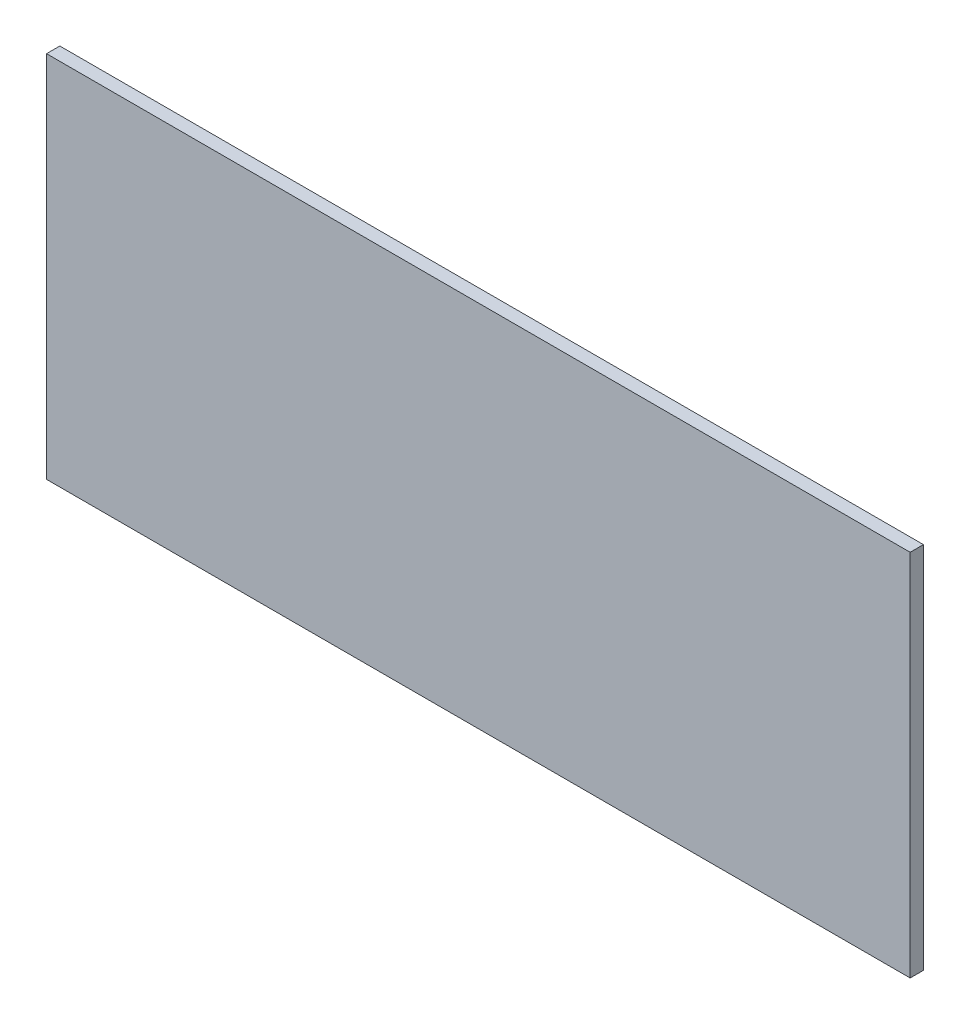
ISO-10303-21;
HEADER;
FILE_DESCRIPTION(('STEP AP214'),'2;1');
FILE_NAME('part.step','',(''),(''),'','','');
FILE_SCHEMA(('AUTOMOTIVE_DESIGN { 1 0 10303 214 1 1 1 1 }'));
ENDSEC;
DATA;
#1=APPLICATION_CONTEXT('core data for automotive mechanical design processes');
#2=APPLICATION_PROTOCOL_DEFINITION('international standard','automotive_design',2000,#1);
#3=PRODUCT_CONTEXT('',#1,'mechanical');
#4=PRODUCT('Part','Part','',(#3));
#5=PRODUCT_RELATED_PRODUCT_CATEGORY('part','',(#4));
#6=PRODUCT_DEFINITION_FORMATION('','',#4);
#7=PRODUCT_DEFINITION_CONTEXT('part definition',#1,'design');
#8=PRODUCT_DEFINITION('design','',#6,#7);
#9=PRODUCT_DEFINITION_SHAPE('','',#8);
#10=(LENGTH_UNIT() NAMED_UNIT(*) SI_UNIT(.MILLI.,.METRE.));
#11=(NAMED_UNIT(*) PLANE_ANGLE_UNIT() SI_UNIT($,.RADIAN.));
#12=(NAMED_UNIT(*) SI_UNIT($,.STERADIAN.) SOLID_ANGLE_UNIT());
#13=UNCERTAINTY_MEASURE_WITH_UNIT(LENGTH_MEASURE(1.E-05),#10,'distance_accuracy_value','');
#14=(GEOMETRIC_REPRESENTATION_CONTEXT(3) GLOBAL_UNCERTAINTY_ASSIGNED_CONTEXT((#13)) GLOBAL_UNIT_ASSIGNED_CONTEXT((#10,
#11,#12)) REPRESENTATION_CONTEXT('',''));
#15=CARTESIAN_POINT('',(0.,0.,0.));
#16=DIRECTION('',(0.,0.,1.));
#17=DIRECTION('',(1.,0.,0.));
#18=AXIS2_PLACEMENT_3D('',#15,#16,#17);
#19=CARTESIAN_POINT('',(-604.955082170042,210.294117647059,20.));
#20=DIRECTION('',(1.,0.,0.));
#21=DIRECTION('',(0.,1.,0.));
#22=AXIS2_PLACEMENT_3D('',#19,#20,#21);
#23=PLANE('',#22);
#24=DIRECTION('',(0.,-1.,0.));
#25=VECTOR('',#24,1.);
#26=CARTESIAN_POINT('',(-604.955082170042,210.294117647059,0.));
#27=LINE('',#26,#25);
#28=CARTESIAN_POINT('',(-604.955082170042,210.294117647059,0.));
#29=VERTEX_POINT('',#28);
#30=CARTESIAN_POINT('',(-604.955082170042,-344.705882352941,0.));
#31=VERTEX_POINT('',#30);
#32=EDGE_CURVE('E96',#29,#31,#27,.T.);
#33=ORIENTED_EDGE('',*,*,#32,.T.);
#34=DIRECTION('',(0.,0.,-1.));
#35=VECTOR('',#34,1.);
#36=CARTESIAN_POINT('',(-604.955082170042,-344.705882352941,20.));
#37=LINE('',#36,#35);
#38=CARTESIAN_POINT('',(-604.955082170042,-344.705882352941,20.));
#39=VERTEX_POINT('',#38);
#40=EDGE_CURVE('E11',#39,#31,#37,.T.);
#41=ORIENTED_EDGE('',*,*,#40,.F.);
#42=DIRECTION('',(0.,-1.,0.));
#43=VECTOR('',#42,1.);
#44=CARTESIAN_POINT('',(-604.955082170042,210.294117647059,20.));
#45=LINE('',#44,#43);
#46=CARTESIAN_POINT('',(-604.955082170042,210.294117647059,20.));
#47=VERTEX_POINT('',#46);
#48=EDGE_CURVE('E84',#47,#39,#45,.T.);
#49=ORIENTED_EDGE('',*,*,#48,.F.);
#50=DIRECTION('',(0.,0.,-1.));
#51=VECTOR('',#50,1.);
#52=CARTESIAN_POINT('',(-604.955082170042,210.294117647059,20.));
#53=LINE('',#52,#51);
#54=EDGE_CURVE('E92',#47,#29,#53,.T.);
#55=ORIENTED_EDGE('',*,*,#54,.T.);
#56=EDGE_LOOP('',(#33,#41,#49,#55));
#57=FACE_BOUND('',#56,.T.);
#58=ADVANCED_FACE('F33',(#57),#23,.F.);
#59=CARTESIAN_POINT('',(-604.955082170042,-344.705882352941,20.));
#60=DIRECTION('',(0.,1.,0.));
#61=DIRECTION('',(0.,0.,1.));
#62=AXIS2_PLACEMENT_3D('',#59,#60,#61);
#63=PLANE('',#62);
#64=DIRECTION('',(1.,0.,0.));
#65=VECTOR('',#64,1.);
#66=CARTESIAN_POINT('',(-604.955082170042,-344.705882352941,0.));
#67=LINE('',#66,#65);
#68=CARTESIAN_POINT('',(695.044917829958,-344.705882352941,0.));
#69=VERTEX_POINT('',#68);
#70=EDGE_CURVE('E88',#31,#69,#67,.T.);
#71=ORIENTED_EDGE('',*,*,#70,.T.);
#72=DIRECTION('',(0.,0.,-1.));
#73=VECTOR('',#72,1.);
#74=CARTESIAN_POINT('',(695.044917829958,-344.705882352941,20.));
#75=LINE('',#74,#73);
#76=CARTESIAN_POINT('',(695.044917829958,-344.705882352941,20.));
#77=VERTEX_POINT('',#76);
#78=EDGE_CURVE('E41',#77,#69,#75,.T.);
#79=ORIENTED_EDGE('',*,*,#78,.F.);
#80=DIRECTION('',(1.,0.,0.));
#81=VECTOR('',#80,1.);
#82=CARTESIAN_POINT('',(-604.955082170042,-344.705882352941,20.));
#83=LINE('',#82,#81);
#84=EDGE_CURVE('E79',#39,#77,#83,.T.);
#85=ORIENTED_EDGE('',*,*,#84,.F.);
#86=ORIENTED_EDGE('',*,*,#40,.T.);
#87=EDGE_LOOP('',(#71,#79,#85,#86));
#88=FACE_BOUND('',#87,.T.);
#89=ADVANCED_FACE('F87',(#88),#63,.F.);
#90=CARTESIAN_POINT('',(695.044917829958,210.294117647059,20.));
#91=DIRECTION('',(-1.,0.,0.));
#92=DIRECTION('',(0.,0.,1.));
#93=AXIS2_PLACEMENT_3D('',#90,#91,#92);
#94=PLANE('',#93);
#95=DIRECTION('',(0.,1.,0.));
#96=VECTOR('',#95,1.);
#97=CARTESIAN_POINT('',(695.044917829958,210.294117647059,0.));
#98=LINE('',#97,#96);
#99=CARTESIAN_POINT('',(695.044917829958,210.294117647059,0.));
#100=VERTEX_POINT('',#99);
#101=EDGE_CURVE('E66',#69,#100,#98,.T.);
#102=ORIENTED_EDGE('',*,*,#101,.T.);
#103=DIRECTION('',(0.,0.,-1.));
#104=VECTOR('',#103,1.);
#105=CARTESIAN_POINT('',(695.044917829958,210.294117647059,20.));
#106=LINE('',#105,#104);
#107=CARTESIAN_POINT('',(695.044917829958,210.294117647059,20.));
#108=VERTEX_POINT('',#107);
#109=EDGE_CURVE('E89',#108,#100,#106,.T.);
#110=ORIENTED_EDGE('',*,*,#109,.F.);
#111=DIRECTION('',(0.,1.,0.));
#112=VECTOR('',#111,1.);
#113=CARTESIAN_POINT('',(695.044917829958,210.294117647059,20.));
#114=LINE('',#113,#112);
#115=EDGE_CURVE('E82',#77,#108,#114,.T.);
#116=ORIENTED_EDGE('',*,*,#115,.F.);
#117=ORIENTED_EDGE('',*,*,#78,.T.);
#118=EDGE_LOOP('',(#102,#110,#116,#117));
#119=FACE_BOUND('',#118,.T.);
#120=ADVANCED_FACE('F90',(#119),#94,.F.);
#121=CARTESIAN_POINT('',(-604.955082170042,210.294117647059,20.));
#122=DIRECTION('',(0.,-1.,0.));
#123=DIRECTION('',(0.,0.,-1.));
#124=AXIS2_PLACEMENT_3D('',#121,#122,#123);
#125=PLANE('',#124);
#126=DIRECTION('',(-1.,0.,0.));
#127=VECTOR('',#126,1.);
#128=CARTESIAN_POINT('',(-604.955082170042,210.294117647059,0.));
#129=LINE('',#128,#127);
#130=EDGE_CURVE('E72',#100,#29,#129,.T.);
#131=ORIENTED_EDGE('',*,*,#130,.T.);
#132=ORIENTED_EDGE('',*,*,#54,.F.);
#133=DIRECTION('',(-1.,0.,0.));
#134=VECTOR('',#133,1.);
#135=CARTESIAN_POINT('',(-604.955082170042,210.294117647059,20.));
#136=LINE('',#135,#134);
#137=EDGE_CURVE('E49',#108,#47,#136,.T.);
#138=ORIENTED_EDGE('',*,*,#137,.F.);
#139=ORIENTED_EDGE('',*,*,#109,.T.);
#140=EDGE_LOOP('',(#131,#132,#138,#139));
#141=FACE_BOUND('',#140,.T.);
#142=ADVANCED_FACE('F103',(#141),#125,.F.);
#143=CARTESIAN_POINT('',(0.,0.,20.));
#144=DIRECTION('',(0.,0.,1.));
#145=DIRECTION('',(1.,0.,0.));
#146=AXIS2_PLACEMENT_3D('',#143,#144,#145);
#147=PLANE('',#146);
#148=ORIENTED_EDGE('',*,*,#48,.T.);
#149=ORIENTED_EDGE('',*,*,#84,.T.);
#150=ORIENTED_EDGE('',*,*,#115,.T.);
#151=ORIENTED_EDGE('',*,*,#137,.T.);
#152=EDGE_LOOP('',(#148,#149,#150,#151));
#153=FACE_BOUND('',#152,.T.);
#154=ADVANCED_FACE('F80',(#153),#147,.T.);
#155=CARTESIAN_POINT('',(0.,0.,0.));
#156=DIRECTION('',(0.,0.,1.));
#157=DIRECTION('',(1.,0.,0.));
#158=AXIS2_PLACEMENT_3D('',#155,#156,#157);
#159=PLANE('',#158);
#160=ORIENTED_EDGE('',*,*,#32,.F.);
#161=ORIENTED_EDGE('',*,*,#130,.F.);
#162=ORIENTED_EDGE('',*,*,#101,.F.);
#163=ORIENTED_EDGE('',*,*,#70,.F.);
#164=EDGE_LOOP('',(#160,#161,#162,#163));
#165=FACE_BOUND('',#164,.T.);
#166=ADVANCED_FACE('F106',(#165),#159,.F.);
#167=CLOSED_SHELL('',(#58,#89,#120,#142,#154,#166));
#168=MANIFOLD_SOLID_BREP('B2',#167);
#169=ADVANCED_BREP_SHAPE_REPRESENTATION('',(#18,#168),#14);
#170=SHAPE_DEFINITION_REPRESENTATION(#9,#169);
ENDSEC;
END-ISO-10303-21;
